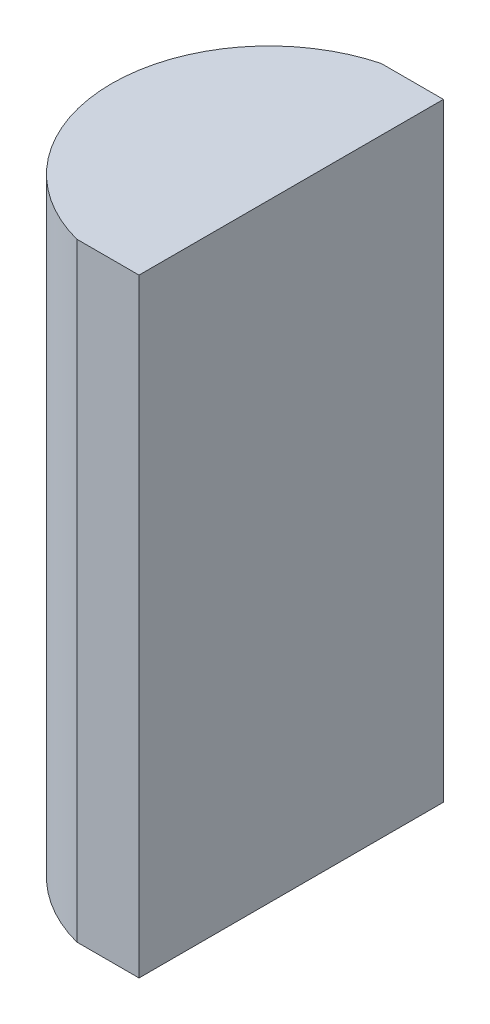
ISO-10303-21;
HEADER;
FILE_DESCRIPTION(('STEP AP214'),'2;1');
FILE_NAME('part.step','',(''),(''),'','','');
FILE_SCHEMA(('AUTOMOTIVE_DESIGN { 1 0 10303 214 1 1 1 1 }'));
ENDSEC;
DATA;
#1=APPLICATION_CONTEXT('core data for automotive mechanical design processes');
#2=APPLICATION_PROTOCOL_DEFINITION('international standard','automotive_design',2000,#1);
#3=PRODUCT_CONTEXT('',#1,'mechanical');
#4=PRODUCT('Part','Part','',(#3));
#5=PRODUCT_RELATED_PRODUCT_CATEGORY('part','',(#4));
#6=PRODUCT_DEFINITION_FORMATION('','',#4);
#7=PRODUCT_DEFINITION_CONTEXT('part definition',#1,'design');
#8=PRODUCT_DEFINITION('design','',#6,#7);
#9=PRODUCT_DEFINITION_SHAPE('','',#8);
#10=(LENGTH_UNIT() NAMED_UNIT(*) SI_UNIT(.MILLI.,.METRE.));
#11=(NAMED_UNIT(*) PLANE_ANGLE_UNIT() SI_UNIT($,.RADIAN.));
#12=(NAMED_UNIT(*) SI_UNIT($,.STERADIAN.) SOLID_ANGLE_UNIT());
#13=UNCERTAINTY_MEASURE_WITH_UNIT(LENGTH_MEASURE(1.E-05),#10,'distance_accuracy_value','');
#14=(GEOMETRIC_REPRESENTATION_CONTEXT(3) GLOBAL_UNCERTAINTY_ASSIGNED_CONTEXT((#13)) GLOBAL_UNIT_ASSIGNED_CONTEXT((#10,
#11,#12)) REPRESENTATION_CONTEXT('',''));
#15=CARTESIAN_POINT('',(0.,0.,0.));
#16=DIRECTION('',(0.,0.,1.));
#17=DIRECTION('',(1.,0.,0.));
#18=AXIS2_PLACEMENT_3D('',#15,#16,#17);
#19=CARTESIAN_POINT('',(4.35520433485127,20.,0.));
#20=DIRECTION('',(0.,-1.,0.));
#21=DIRECTION('',(0.,0.,-1.));
#22=AXIS2_PLACEMENT_3D('',#19,#20,#21);
#23=CYLINDRICAL_SURFACE('',#22,5.17);
#24=CARTESIAN_POINT('',(4.35520433485127,0.,0.));
#25=DIRECTION('',(0.,1.,0.));
#26=DIRECTION('',(0.,0.,1.));
#27=AXIS2_PLACEMENT_3D('',#24,#25,#26);
#28=CIRCLE('',#27,5.17);
#29=CARTESIAN_POINT('',(3.04032791480259,0.,-5.));
#30=VERTEX_POINT('',#29);
#31=CARTESIAN_POINT('',(3.04032791480259,0.,5.));
#32=VERTEX_POINT('',#31);
#33=EDGE_CURVE('E100',#30,#32,#28,.T.);
#34=ORIENTED_EDGE('',*,*,#33,.T.);
#35=DIRECTION('',(0.,-1.,0.));
#36=VECTOR('',#35,1.);
#37=CARTESIAN_POINT('',(3.04032791480259,20.,5.));
#38=LINE('',#37,#36);
#39=CARTESIAN_POINT('',(3.04032791480259,20.,5.));
#40=VERTEX_POINT('',#39);
#41=EDGE_CURVE('E11',#40,#32,#38,.T.);
#42=ORIENTED_EDGE('',*,*,#41,.F.);
#43=CARTESIAN_POINT('',(4.35520433485127,20.,0.));
#44=DIRECTION('',(0.,1.,0.));
#45=DIRECTION('',(0.,0.,1.));
#46=AXIS2_PLACEMENT_3D('',#43,#44,#45);
#47=CIRCLE('',#46,5.17);
#48=CARTESIAN_POINT('',(3.04032791480259,20.,-5.));
#49=VERTEX_POINT('',#48);
#50=EDGE_CURVE('E88',#49,#40,#47,.T.);
#51=ORIENTED_EDGE('',*,*,#50,.F.);
#52=DIRECTION('',(0.,-1.,0.));
#53=VECTOR('',#52,1.);
#54=CARTESIAN_POINT('',(3.04032791480259,20.,-5.));
#55=LINE('',#54,#53);
#56=EDGE_CURVE('E96',#49,#30,#55,.T.);
#57=ORIENTED_EDGE('',*,*,#56,.T.);
#58=EDGE_LOOP('',(#34,#42,#51,#57));
#59=FACE_BOUND('',#58,.T.);
#60=ADVANCED_FACE('F37',(#59),#23,.T.);
#61=CARTESIAN_POINT('',(3.04032791480259,20.,5.));
#62=DIRECTION('',(0.,0.,-1.));
#63=DIRECTION('',(-1.,0.,0.));
#64=AXIS2_PLACEMENT_3D('',#61,#62,#63);
#65=PLANE('',#64);
#66=DIRECTION('',(1.,0.,0.));
#67=VECTOR('',#66,1.);
#68=CARTESIAN_POINT('',(3.04032791480259,0.,5.));
#69=LINE('',#68,#67);
#70=CARTESIAN_POINT('',(5.08520433485127,0.,5.));
#71=VERTEX_POINT('',#70);
#72=EDGE_CURVE('E92',#32,#71,#69,.T.);
#73=ORIENTED_EDGE('',*,*,#72,.T.);
#74=DIRECTION('',(0.,-1.,0.));
#75=VECTOR('',#74,1.);
#76=CARTESIAN_POINT('',(5.08520433485127,20.,5.));
#77=LINE('',#76,#75);
#78=CARTESIAN_POINT('',(5.08520433485127,20.,5.));
#79=VERTEX_POINT('',#78);
#80=EDGE_CURVE('E45',#79,#71,#77,.T.);
#81=ORIENTED_EDGE('',*,*,#80,.F.);
#82=DIRECTION('',(1.,0.,0.));
#83=VECTOR('',#82,1.);
#84=CARTESIAN_POINT('',(3.04032791480259,20.,5.));
#85=LINE('',#84,#83);
#86=EDGE_CURVE('E83',#40,#79,#85,.T.);
#87=ORIENTED_EDGE('',*,*,#86,.F.);
#88=ORIENTED_EDGE('',*,*,#41,.T.);
#89=EDGE_LOOP('',(#73,#81,#87,#88));
#90=FACE_BOUND('',#89,.T.);
#91=ADVANCED_FACE('F91',(#90),#65,.F.);
#92=CARTESIAN_POINT('',(5.08520433485126,20.,-5.00000000000001));
#93=DIRECTION('',(-1.,0.,0.));
#94=DIRECTION('',(0.,0.,1.));
#95=AXIS2_PLACEMENT_3D('',#92,#93,#94);
#96=PLANE('',#95);
#97=DIRECTION('',(0.,0.,-1.));
#98=VECTOR('',#97,1.);
#99=CARTESIAN_POINT('',(5.08520433485126,0.,-5.00000000000001));
#100=LINE('',#99,#98);
#101=CARTESIAN_POINT('',(5.08520433485126,0.,-5.00000000000001));
#102=VERTEX_POINT('',#101);
#103=EDGE_CURVE('E70',#71,#102,#100,.T.);
#104=ORIENTED_EDGE('',*,*,#103,.T.);
#105=DIRECTION('',(0.,-1.,0.));
#106=VECTOR('',#105,1.);
#107=CARTESIAN_POINT('',(5.08520433485126,20.,-5.00000000000001));
#108=LINE('',#107,#106);
#109=CARTESIAN_POINT('',(5.08520433485126,20.,-5.00000000000001));
#110=VERTEX_POINT('',#109);
#111=EDGE_CURVE('E93',#110,#102,#108,.T.);
#112=ORIENTED_EDGE('',*,*,#111,.F.);
#113=DIRECTION('',(0.,0.,-1.));
#114=VECTOR('',#113,1.);
#115=CARTESIAN_POINT('',(5.08520433485126,20.,-5.00000000000001));
#116=LINE('',#115,#114);
#117=EDGE_CURVE('E86',#79,#110,#116,.T.);
#118=ORIENTED_EDGE('',*,*,#117,.F.);
#119=ORIENTED_EDGE('',*,*,#80,.T.);
#120=EDGE_LOOP('',(#104,#112,#118,#119));
#121=FACE_BOUND('',#120,.T.);
#122=ADVANCED_FACE('F94',(#121),#96,.F.);
#123=CARTESIAN_POINT('',(3.04032791480259,20.,-5.));
#124=DIRECTION('',(0.,0.,1.));
#125=DIRECTION('',(1.,0.,0.));
#126=AXIS2_PLACEMENT_3D('',#123,#124,#125);
#127=PLANE('',#126);
#128=DIRECTION('',(-1.,0.,0.));
#129=VECTOR('',#128,1.);
#130=CARTESIAN_POINT('',(3.04032791480259,0.,-5.));
#131=LINE('',#130,#129);
#132=EDGE_CURVE('E76',#102,#30,#131,.T.);
#133=ORIENTED_EDGE('',*,*,#132,.T.);
#134=ORIENTED_EDGE('',*,*,#56,.F.);
#135=DIRECTION('',(-1.,0.,0.));
#136=VECTOR('',#135,1.);
#137=CARTESIAN_POINT('',(3.04032791480259,20.,-5.));
#138=LINE('',#137,#136);
#139=EDGE_CURVE('E53',#110,#49,#138,.T.);
#140=ORIENTED_EDGE('',*,*,#139,.F.);
#141=ORIENTED_EDGE('',*,*,#111,.T.);
#142=EDGE_LOOP('',(#133,#134,#140,#141));
#143=FACE_BOUND('',#142,.T.);
#144=ADVANCED_FACE('F107',(#143),#127,.F.);
#145=CARTESIAN_POINT('',(4.35520433485127,20.,0.));
#146=DIRECTION('',(0.,1.,0.));
#147=DIRECTION('',(0.,0.,1.));
#148=AXIS2_PLACEMENT_3D('',#145,#146,#147);
#149=PLANE('',#148);
#150=ORIENTED_EDGE('',*,*,#50,.T.);
#151=ORIENTED_EDGE('',*,*,#86,.T.);
#152=ORIENTED_EDGE('',*,*,#117,.T.);
#153=ORIENTED_EDGE('',*,*,#139,.T.);
#154=EDGE_LOOP('',(#150,#151,#152,#153));
#155=FACE_BOUND('',#154,.T.);
#156=ADVANCED_FACE('F84',(#155),#149,.T.);
#157=CARTESIAN_POINT('',(4.35520433485127,0.,0.));
#158=DIRECTION('',(0.,1.,0.));
#159=DIRECTION('',(0.,0.,1.));
#160=AXIS2_PLACEMENT_3D('',#157,#158,#159);
#161=PLANE('',#160);
#162=ORIENTED_EDGE('',*,*,#33,.F.);
#163=ORIENTED_EDGE('',*,*,#132,.F.);
#164=ORIENTED_EDGE('',*,*,#103,.F.);
#165=ORIENTED_EDGE('',*,*,#72,.F.);
#166=EDGE_LOOP('',(#162,#163,#164,#165));
#167=FACE_BOUND('',#166,.T.);
#168=ADVANCED_FACE('F110',(#167),#161,.F.);
#169=CLOSED_SHELL('',(#60,#91,#122,#144,#156,#168));
#170=MANIFOLD_SOLID_BREP('B2',#169);
#171=ADVANCED_BREP_SHAPE_REPRESENTATION('',(#18,#170),#14);
#172=SHAPE_DEFINITION_REPRESENTATION(#9,#171);
ENDSEC;
END-ISO-10303-21;
